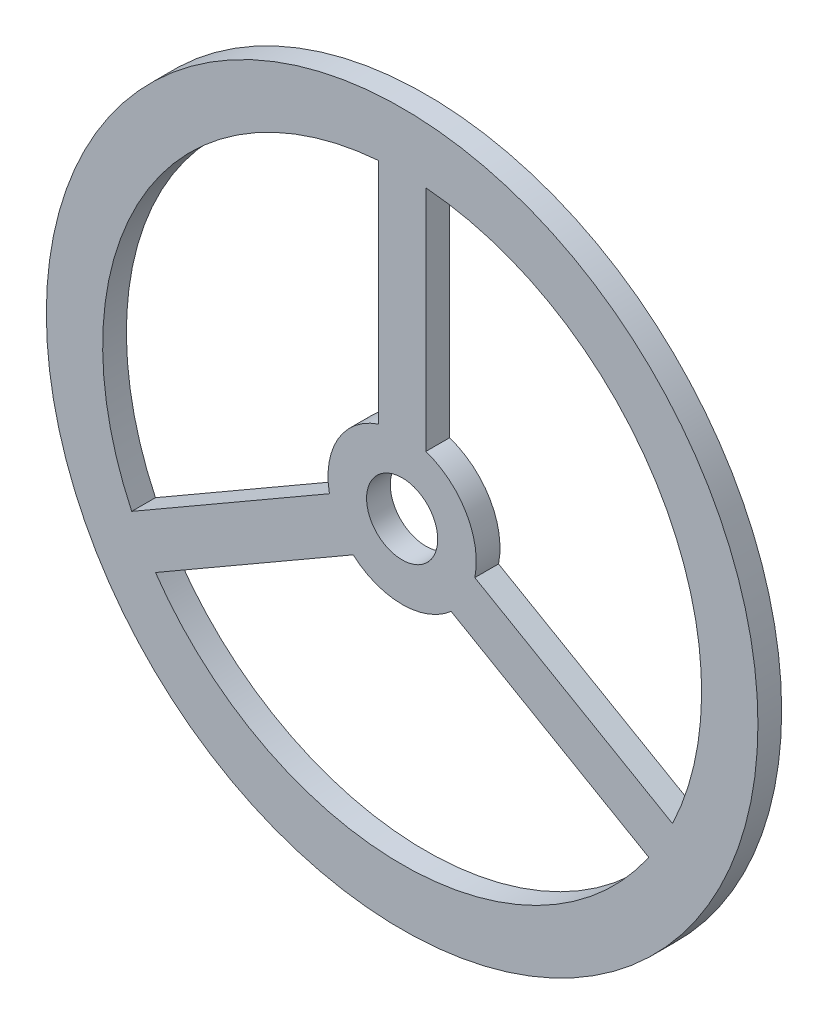
ISO-10303-21;
HEADER;
FILE_DESCRIPTION(('STEP AP214'),'2;1');
FILE_NAME('part.step','',(''),(''),'','','');
FILE_SCHEMA(('AUTOMOTIVE_DESIGN { 1 0 10303 214 1 1 1 1 }'));
ENDSEC;
DATA;
#1=APPLICATION_CONTEXT('core data for automotive mechanical design processes');
#2=APPLICATION_PROTOCOL_DEFINITION('international standard','automotive_design',2000,#1);
#3=PRODUCT_CONTEXT('',#1,'mechanical');
#4=PRODUCT('Part','Part','',(#3));
#5=PRODUCT_RELATED_PRODUCT_CATEGORY('part','',(#4));
#6=PRODUCT_DEFINITION_FORMATION('','',#4);
#7=PRODUCT_DEFINITION_CONTEXT('part definition',#1,'design');
#8=PRODUCT_DEFINITION('design','',#6,#7);
#9=PRODUCT_DEFINITION_SHAPE('','',#8);
#10=(LENGTH_UNIT() NAMED_UNIT(*) SI_UNIT(.MILLI.,.METRE.));
#11=(NAMED_UNIT(*) PLANE_ANGLE_UNIT() SI_UNIT($,.RADIAN.));
#12=(NAMED_UNIT(*) SI_UNIT($,.STERADIAN.) SOLID_ANGLE_UNIT());
#13=UNCERTAINTY_MEASURE_WITH_UNIT(LENGTH_MEASURE(1.E-05),#10,'distance_accuracy_value','');
#14=(GEOMETRIC_REPRESENTATION_CONTEXT(3) GLOBAL_UNCERTAINTY_ASSIGNED_CONTEXT((#13)) GLOBAL_UNIT_ASSIGNED_CONTEXT((#10,
#11,#12)) REPRESENTATION_CONTEXT('',''));
#15=CARTESIAN_POINT('',(0.,0.,0.));
#16=DIRECTION('',(0.,0.,1.));
#17=DIRECTION('',(1.,0.,0.));
#18=AXIS2_PLACEMENT_3D('',#15,#16,#17);
#19=CARTESIAN_POINT('',(0.,0.,4.));
#20=DIRECTION('',(0.,0.,1.));
#21=DIRECTION('',(1.,0.,0.));
#22=AXIS2_PLACEMENT_3D('',#19,#20,#21);
#23=PLANE('',#22);
#24=CARTESIAN_POINT('',(0.,0.,4.));
#25=DIRECTION('',(0.,0.,1.));
#26=DIRECTION('',(1.,0.,0.));
#27=AXIS2_PLACEMENT_3D('',#24,#25,#26);
#28=CIRCLE('',#27,60.);
#29=CARTESIAN_POINT('',(60.,0.,4.));
#30=VERTEX_POINT('',#29);
#31=EDGE_CURVE('E11',#30,#30,#28,.T.);
#32=ORIENTED_EDGE('',*,*,#31,.T.);
#33=EDGE_LOOP('',(#32));
#34=FACE_BOUND('',#33,.T.);
#35=CARTESIAN_POINT('',(0.,0.,4.));
#36=DIRECTION('',(0.,0.,1.));
#37=DIRECTION('',(1.,0.,0.));
#38=AXIS2_PLACEMENT_3D('',#35,#36,#37);
#39=CIRCLE('',#38,6.);
#40=CARTESIAN_POINT('',(6.,0.,4.));
#41=VERTEX_POINT('',#40);
#42=EDGE_CURVE('E220',#41,#41,#39,.T.);
#43=ORIENTED_EDGE('',*,*,#42,.F.);
#44=EDGE_LOOP('',(#43));
#45=FACE_BOUND('',#44,.T.);
#46=DIRECTION('',(0.,1.,0.));
#47=VECTOR('',#46,1.);
#48=CARTESIAN_POINT('',(-4.,11.842719282327,4.));
#49=LINE('',#48,#47);
#50=CARTESIAN_POINT('',(-4.,11.842719282327,4.));
#51=VERTEX_POINT('',#50);
#52=CARTESIAN_POINT('',(-4.,50.3413349048275,4.));
#53=VERTEX_POINT('',#52);
#54=EDGE_CURVE('E191',#51,#53,#49,.T.);
#55=ORIENTED_EDGE('',*,*,#54,.F.);
#56=CARTESIAN_POINT('',(0.,0.,4.));
#57=DIRECTION('',(0.,0.,-1.));
#58=DIRECTION('',(1.,0.,0.));
#59=AXIS2_PLACEMENT_3D('',#56,#57,#58);
#60=CIRCLE('',#59,12.5);
#61=CARTESIAN_POINT('',(-12.256095748383,-2.45725802602564,4.));
#62=VERTEX_POINT('',#61);
#63=EDGE_CURVE('E189',#62,#51,#60,.T.);
#64=ORIENTED_EDGE('',*,*,#63,.F.);
#65=DIRECTION('',(0.866025403784437,0.500000000000003,0.));
#66=VECTOR('',#65,1.);
#67=CARTESIAN_POINT('',(-12.256095748383,-2.45725802602564,4.));
#68=LINE('',#67,#66);
#69=CARTESIAN_POINT('',(-45.5968748880008,-21.706565837276,4.));
#70=VERTEX_POINT('',#69);
#71=EDGE_CURVE('E197',#70,#62,#68,.T.);
#72=ORIENTED_EDGE('',*,*,#71,.F.);
#73=CARTESIAN_POINT('',(0.,0.,4.));
#74=DIRECTION('',(0.,0.,1.));
#75=DIRECTION('',(1.,0.,0.));
#76=AXIS2_PLACEMENT_3D('',#73,#74,#75);
#77=CIRCLE('',#76,50.5);
#78=EDGE_CURVE('E194',#53,#70,#77,.T.);
#79=ORIENTED_EDGE('',*,*,#78,.F.);
#80=EDGE_LOOP('',(#55,#64,#72,#79));
#81=FACE_BOUND('',#80,.T.);
#82=DIRECTION('',(0.866025403784439,-0.499999999999998,0.));
#83=VECTOR('',#82,1.);
#84=CARTESIAN_POINT('',(12.256095748383,-2.45725802602581,4.));
#85=LINE('',#84,#83);
#86=CARTESIAN_POINT('',(12.256095748383,-2.45725802602581,4.));
#87=VERTEX_POINT('',#86);
#88=CARTESIAN_POINT('',(45.5968748880009,-21.706565837276,4.));
#89=VERTEX_POINT('',#88);
#90=EDGE_CURVE('E160',#87,#89,#85,.T.);
#91=ORIENTED_EDGE('',*,*,#90,.F.);
#92=CARTESIAN_POINT('',(0.,0.,4.));
#93=DIRECTION('',(0.,0.,-1.));
#94=DIRECTION('',(1.,0.,0.));
#95=AXIS2_PLACEMENT_3D('',#92,#93,#94);
#96=CIRCLE('',#95,12.5);
#97=CARTESIAN_POINT('',(4.,11.842719282327,4.));
#98=VERTEX_POINT('',#97);
#99=EDGE_CURVE('E158',#98,#87,#96,.T.);
#100=ORIENTED_EDGE('',*,*,#99,.F.);
#101=DIRECTION('',(0.,-1.,0.));
#102=VECTOR('',#101,1.);
#103=CARTESIAN_POINT('',(4.,11.842719282327,4.));
#104=LINE('',#103,#102);
#105=CARTESIAN_POINT('',(4.,50.3413349048275,4.));
#106=VERTEX_POINT('',#105);
#107=EDGE_CURVE('E166',#106,#98,#104,.T.);
#108=ORIENTED_EDGE('',*,*,#107,.F.);
#109=CARTESIAN_POINT('',(0.,0.,4.));
#110=DIRECTION('',(0.,0.,1.));
#111=DIRECTION('',(1.,0.,0.));
#112=AXIS2_PLACEMENT_3D('',#109,#110,#111);
#113=CIRCLE('',#112,50.5);
#114=EDGE_CURVE('E163',#89,#106,#113,.T.);
#115=ORIENTED_EDGE('',*,*,#114,.F.);
#116=EDGE_LOOP('',(#91,#100,#108,#115));
#117=FACE_BOUND('',#116,.T.);
#118=DIRECTION('',(-0.866025403784437,-0.500000000000003,0.));
#119=VECTOR('',#118,1.);
#120=CARTESIAN_POINT('',(-8.2560957483831,-9.38546125630118,4.));
#121=LINE('',#120,#119);
#122=CARTESIAN_POINT('',(-8.2560957483831,-9.38546125630118,4.));
#123=VERTEX_POINT('',#122);
#124=CARTESIAN_POINT('',(-41.5968748880009,-28.6347690675515,4.));
#125=VERTEX_POINT('',#124);
#126=EDGE_CURVE('E130',#123,#125,#121,.T.);
#127=ORIENTED_EDGE('',*,*,#126,.F.);
#128=CARTESIAN_POINT('',(0.,0.,4.));
#129=DIRECTION('',(0.,0.,-1.));
#130=DIRECTION('',(1.,0.,0.));
#131=AXIS2_PLACEMENT_3D('',#128,#129,#130);
#132=CIRCLE('',#131,12.5);
#133=CARTESIAN_POINT('',(8.25609574838296,-9.3854612563013,4.));
#134=VERTEX_POINT('',#133);
#135=EDGE_CURVE('E122',#134,#123,#132,.T.);
#136=ORIENTED_EDGE('',*,*,#135,.F.);
#137=DIRECTION('',(-0.86602540378444,0.499999999999998,0.));
#138=VECTOR('',#137,1.);
#139=CARTESIAN_POINT('',(8.25609574838296,-9.3854612563013,4.));
#140=LINE('',#139,#138);
#141=CARTESIAN_POINT('',(41.5968748880009,-28.6347690675515,4.));
#142=VERTEX_POINT('',#141);
#143=EDGE_CURVE('E144',#142,#134,#140,.T.);
#144=ORIENTED_EDGE('',*,*,#143,.F.);
#145=CARTESIAN_POINT('',(0.,0.,4.));
#146=DIRECTION('',(0.,0.,1.));
#147=DIRECTION('',(1.,0.,0.));
#148=AXIS2_PLACEMENT_3D('',#145,#146,#147);
#149=CIRCLE('',#148,50.5);
#150=EDGE_CURVE('E142',#125,#142,#149,.T.);
#151=ORIENTED_EDGE('',*,*,#150,.F.);
#152=EDGE_LOOP('',(#127,#136,#144,#151));
#153=FACE_BOUND('',#152,.T.);
#154=ADVANCED_FACE('F33',(#34,#45,#81,#117,#153),#23,.T.);
#155=CARTESIAN_POINT('',(0.,0.,0.));
#156=DIRECTION('',(0.,0.,1.));
#157=DIRECTION('',(1.,0.,0.));
#158=AXIS2_PLACEMENT_3D('',#155,#156,#157);
#159=PLANE('',#158);
#160=CARTESIAN_POINT('',(0.,0.,0.));
#161=DIRECTION('',(0.,0.,-1.));
#162=DIRECTION('',(1.,0.,0.));
#163=AXIS2_PLACEMENT_3D('',#160,#161,#162);
#164=CIRCLE('',#163,12.5);
#165=CARTESIAN_POINT('',(4.,11.842719282327,0.));
#166=VERTEX_POINT('',#165);
#167=CARTESIAN_POINT('',(12.256095748383,-2.45725802602581,0.));
#168=VERTEX_POINT('',#167);
#169=EDGE_CURVE('E138',#166,#168,#164,.T.);
#170=ORIENTED_EDGE('',*,*,#169,.T.);
#171=DIRECTION('',(0.866025403784439,-0.499999999999998,0.));
#172=VECTOR('',#171,1.);
#173=CARTESIAN_POINT('',(12.256095748383,-2.45725802602581,0.));
#174=LINE('',#173,#172);
#175=CARTESIAN_POINT('',(45.5968748880009,-21.706565837276,0.));
#176=VERTEX_POINT('',#175);
#177=EDGE_CURVE('E171',#168,#176,#174,.T.);
#178=ORIENTED_EDGE('',*,*,#177,.T.);
#179=CARTESIAN_POINT('',(0.,0.,0.));
#180=DIRECTION('',(0.,0.,1.));
#181=DIRECTION('',(1.,0.,0.));
#182=AXIS2_PLACEMENT_3D('',#179,#180,#181);
#183=CIRCLE('',#182,50.5);
#184=CARTESIAN_POINT('',(4.,50.3413349048275,0.));
#185=VERTEX_POINT('',#184);
#186=EDGE_CURVE('E174',#176,#185,#183,.T.);
#187=ORIENTED_EDGE('',*,*,#186,.T.);
#188=DIRECTION('',(0.,-1.,0.));
#189=VECTOR('',#188,1.);
#190=CARTESIAN_POINT('',(4.,11.842719282327,0.));
#191=LINE('',#190,#189);
#192=EDGE_CURVE('E161',#185,#166,#191,.T.);
#193=ORIENTED_EDGE('',*,*,#192,.T.);
#194=EDGE_LOOP('',(#170,#178,#187,#193));
#195=FACE_BOUND('',#194,.T.);
#196=CARTESIAN_POINT('',(0.,0.,0.));
#197=DIRECTION('',(0.,0.,1.));
#198=DIRECTION('',(1.,0.,0.));
#199=AXIS2_PLACEMENT_3D('',#196,#197,#198);
#200=CIRCLE('',#199,6.);
#201=CARTESIAN_POINT('',(6.,0.,0.));
#202=VERTEX_POINT('',#201);
#203=EDGE_CURVE('E219',#202,#202,#200,.T.);
#204=ORIENTED_EDGE('',*,*,#203,.T.);
#205=EDGE_LOOP('',(#204));
#206=FACE_BOUND('',#205,.T.);
#207=CARTESIAN_POINT('',(0.,0.,0.));
#208=DIRECTION('',(0.,0.,1.));
#209=DIRECTION('',(1.,0.,0.));
#210=AXIS2_PLACEMENT_3D('',#207,#208,#209);
#211=CIRCLE('',#210,60.);
#212=CARTESIAN_POINT('',(60.,0.,0.));
#213=VERTEX_POINT('',#212);
#214=EDGE_CURVE('E37',#213,#213,#211,.T.);
#215=ORIENTED_EDGE('',*,*,#214,.F.);
#216=EDGE_LOOP('',(#215));
#217=FACE_BOUND('',#216,.T.);
#218=CARTESIAN_POINT('',(0.,0.,0.));
#219=DIRECTION('',(0.,0.,-1.));
#220=DIRECTION('',(1.,0.,0.));
#221=AXIS2_PLACEMENT_3D('',#218,#219,#220);
#222=CIRCLE('',#221,12.5);
#223=CARTESIAN_POINT('',(-12.256095748383,-2.45725802602564,0.));
#224=VERTEX_POINT('',#223);
#225=CARTESIAN_POINT('',(-4.,11.842719282327,0.));
#226=VERTEX_POINT('',#225);
#227=EDGE_CURVE('E188',#224,#226,#222,.T.);
#228=ORIENTED_EDGE('',*,*,#227,.T.);
#229=DIRECTION('',(0.,1.,0.));
#230=VECTOR('',#229,1.);
#231=CARTESIAN_POINT('',(-4.,11.842719282327,0.));
#232=LINE('',#231,#230);
#233=CARTESIAN_POINT('',(-4.,50.3413349048275,0.));
#234=VERTEX_POINT('',#233);
#235=EDGE_CURVE('E202',#226,#234,#232,.T.);
#236=ORIENTED_EDGE('',*,*,#235,.T.);
#237=CARTESIAN_POINT('',(0.,0.,0.));
#238=DIRECTION('',(0.,0.,1.));
#239=DIRECTION('',(1.,0.,0.));
#240=AXIS2_PLACEMENT_3D('',#237,#238,#239);
#241=CIRCLE('',#240,50.5);
#242=CARTESIAN_POINT('',(-45.5968748880008,-21.706565837276,0.));
#243=VERTEX_POINT('',#242);
#244=EDGE_CURVE('E205',#234,#243,#241,.T.);
#245=ORIENTED_EDGE('',*,*,#244,.T.);
#246=DIRECTION('',(0.866025403784437,0.500000000000003,0.));
#247=VECTOR('',#246,1.);
#248=CARTESIAN_POINT('',(-12.256095748383,-2.45725802602564,0.));
#249=LINE('',#248,#247);
#250=EDGE_CURVE('E192',#243,#224,#249,.T.);
#251=ORIENTED_EDGE('',*,*,#250,.T.);
#252=EDGE_LOOP('',(#228,#236,#245,#251));
#253=FACE_BOUND('',#252,.T.);
#254=CARTESIAN_POINT('',(0.,0.,0.));
#255=DIRECTION('',(0.,0.,-1.));
#256=DIRECTION('',(1.,0.,0.));
#257=AXIS2_PLACEMENT_3D('',#254,#255,#256);
#258=CIRCLE('',#257,12.5);
#259=CARTESIAN_POINT('',(8.25609574838296,-9.3854612563013,0.));
#260=VERTEX_POINT('',#259);
#261=CARTESIAN_POINT('',(-8.2560957483831,-9.38546125630118,0.));
#262=VERTEX_POINT('',#261);
#263=EDGE_CURVE('E56',#260,#262,#258,.T.);
#264=ORIENTED_EDGE('',*,*,#263,.T.);
#265=DIRECTION('',(-0.866025403784437,-0.500000000000003,0.));
#266=VECTOR('',#265,1.);
#267=CARTESIAN_POINT('',(-8.2560957483831,-9.38546125630118,0.));
#268=LINE('',#267,#266);
#269=CARTESIAN_POINT('',(-41.5968748880009,-28.6347690675515,0.));
#270=VERTEX_POINT('',#269);
#271=EDGE_CURVE('E137',#262,#270,#268,.T.);
#272=ORIENTED_EDGE('',*,*,#271,.T.);
#273=CARTESIAN_POINT('',(0.,0.,0.));
#274=DIRECTION('',(0.,0.,1.));
#275=DIRECTION('',(1.,0.,0.));
#276=AXIS2_PLACEMENT_3D('',#273,#274,#275);
#277=CIRCLE('',#276,50.5);
#278=CARTESIAN_POINT('',(41.5968748880009,-28.6347690675515,0.));
#279=VERTEX_POINT('',#278);
#280=EDGE_CURVE('E150',#270,#279,#277,.T.);
#281=ORIENTED_EDGE('',*,*,#280,.T.);
#282=DIRECTION('',(-0.86602540378444,0.499999999999998,0.));
#283=VECTOR('',#282,1.);
#284=CARTESIAN_POINT('',(8.25609574838296,-9.3854612563013,0.));
#285=LINE('',#284,#283);
#286=EDGE_CURVE('E131',#279,#260,#285,.T.);
#287=ORIENTED_EDGE('',*,*,#286,.T.);
#288=EDGE_LOOP('',(#264,#272,#281,#287));
#289=FACE_BOUND('',#288,.T.);
#290=ADVANCED_FACE('F226',(#195,#206,#217,#253,#289),#159,.F.);
#291=CARTESIAN_POINT('',(0.,0.,4.));
#292=DIRECTION('',(0.,0.,-1.));
#293=DIRECTION('',(-1.,0.,0.));
#294=AXIS2_PLACEMENT_3D('',#291,#292,#293);
#295=CYLINDRICAL_SURFACE('',#294,60.);
#296=ORIENTED_EDGE('',*,*,#31,.F.);
#297=EDGE_LOOP('',(#296));
#298=FACE_BOUND('',#297,.T.);
#299=ORIENTED_EDGE('',*,*,#214,.T.);
#300=EDGE_LOOP('',(#299));
#301=FACE_BOUND('',#300,.T.);
#302=ADVANCED_FACE('F35',(#298,#301),#295,.T.);
#303=CARTESIAN_POINT('',(0.,0.,4.));
#304=DIRECTION('',(0.,0.,-1.));
#305=DIRECTION('',(-1.,0.,0.));
#306=AXIS2_PLACEMENT_3D('',#303,#304,#305);
#307=CYLINDRICAL_SURFACE('',#306,6.);
#308=ORIENTED_EDGE('',*,*,#42,.T.);
#309=EDGE_LOOP('',(#308));
#310=FACE_BOUND('',#309,.T.);
#311=ORIENTED_EDGE('',*,*,#203,.F.);
#312=EDGE_LOOP('',(#311));
#313=FACE_BOUND('',#312,.T.);
#314=ADVANCED_FACE('F229',(#310,#313),#307,.F.);
#315=CARTESIAN_POINT('',(0.,0.,4.));
#316=DIRECTION('',(0.,0.,-1.));
#317=DIRECTION('',(-1.,0.,0.));
#318=AXIS2_PLACEMENT_3D('',#315,#316,#317);
#319=CYLINDRICAL_SURFACE('',#318,12.5);
#320=ORIENTED_EDGE('',*,*,#227,.F.);
#321=DIRECTION('',(0.,0.,-1.));
#322=VECTOR('',#321,1.);
#323=CARTESIAN_POINT('',(-12.256095748383,-2.45725802602564,4.));
#324=LINE('',#323,#322);
#325=EDGE_CURVE('E199',#62,#224,#324,.T.);
#326=ORIENTED_EDGE('',*,*,#325,.F.);
#327=ORIENTED_EDGE('',*,*,#63,.T.);
#328=DIRECTION('',(0.,0.,-1.));
#329=VECTOR('',#328,1.);
#330=CARTESIAN_POINT('',(-4.,11.842719282327,4.));
#331=LINE('',#330,#329);
#332=EDGE_CURVE('E216',#51,#226,#331,.T.);
#333=ORIENTED_EDGE('',*,*,#332,.T.);
#334=EDGE_LOOP('',(#320,#326,#327,#333));
#335=FACE_BOUND('',#334,.T.);
#336=ADVANCED_FACE('F231',(#335),#319,.T.);
#337=CARTESIAN_POINT('',(-4.,11.842719282327,4.));
#338=DIRECTION('',(-1.,0.,0.));
#339=DIRECTION('',(0.,0.,1.));
#340=AXIS2_PLACEMENT_3D('',#337,#338,#339);
#341=PLANE('',#340);
#342=ORIENTED_EDGE('',*,*,#235,.F.);
#343=ORIENTED_EDGE('',*,*,#332,.F.);
#344=ORIENTED_EDGE('',*,*,#54,.T.);
#345=DIRECTION('',(0.,0.,-1.));
#346=VECTOR('',#345,1.);
#347=CARTESIAN_POINT('',(-4.,50.3413349048275,4.));
#348=LINE('',#347,#346);
#349=EDGE_CURVE('E214',#53,#234,#348,.T.);
#350=ORIENTED_EDGE('',*,*,#349,.T.);
#351=EDGE_LOOP('',(#342,#343,#344,#350));
#352=FACE_BOUND('',#351,.T.);
#353=ADVANCED_FACE('F238',(#352),#341,.T.);
#354=CARTESIAN_POINT('',(0.,0.,4.));
#355=DIRECTION('',(0.,0.,-1.));
#356=DIRECTION('',(-1.,0.,0.));
#357=AXIS2_PLACEMENT_3D('',#354,#355,#356);
#358=CYLINDRICAL_SURFACE('',#357,50.5);
#359=ORIENTED_EDGE('',*,*,#244,.F.);
#360=ORIENTED_EDGE('',*,*,#349,.F.);
#361=ORIENTED_EDGE('',*,*,#78,.T.);
#362=DIRECTION('',(0.,0.,-1.));
#363=VECTOR('',#362,1.);
#364=CARTESIAN_POINT('',(-45.5968748880008,-21.706565837276,4.));
#365=LINE('',#364,#363);
#366=EDGE_CURVE('E212',#70,#243,#365,.T.);
#367=ORIENTED_EDGE('',*,*,#366,.T.);
#368=EDGE_LOOP('',(#359,#360,#361,#367));
#369=FACE_BOUND('',#368,.T.);
#370=ADVANCED_FACE('F291',(#369),#358,.F.);
#371=CARTESIAN_POINT('',(-12.256095748383,-2.45725802602564,4.));
#372=DIRECTION('',(-0.500000000000003,0.866025403784437,0.));
#373=DIRECTION('',(-0.866025403784437,-0.500000000000003,0.));
#374=AXIS2_PLACEMENT_3D('',#371,#372,#373);
#375=PLANE('',#374);
#376=ORIENTED_EDGE('',*,*,#250,.F.);
#377=ORIENTED_EDGE('',*,*,#366,.F.);
#378=ORIENTED_EDGE('',*,*,#71,.T.);
#379=ORIENTED_EDGE('',*,*,#325,.T.);
#380=EDGE_LOOP('',(#376,#377,#378,#379));
#381=FACE_BOUND('',#380,.T.);
#382=ADVANCED_FACE('F288',(#381),#375,.T.);
#383=CARTESIAN_POINT('',(0.,0.,4.));
#384=DIRECTION('',(0.,0.,-1.));
#385=DIRECTION('',(-1.,0.,0.));
#386=AXIS2_PLACEMENT_3D('',#383,#384,#385);
#387=CYLINDRICAL_SURFACE('',#386,12.5);
#388=ORIENTED_EDGE('',*,*,#169,.F.);
#389=DIRECTION('',(0.,0.,-1.));
#390=VECTOR('',#389,1.);
#391=CARTESIAN_POINT('',(4.,11.842719282327,4.));
#392=LINE('',#391,#390);
#393=EDGE_CURVE('E168',#98,#166,#392,.T.);
#394=ORIENTED_EDGE('',*,*,#393,.F.);
#395=ORIENTED_EDGE('',*,*,#99,.T.);
#396=DIRECTION('',(0.,0.,-1.));
#397=VECTOR('',#396,1.);
#398=CARTESIAN_POINT('',(12.256095748383,-2.45725802602581,4.));
#399=LINE('',#398,#397);
#400=EDGE_CURVE('E185',#87,#168,#399,.T.);
#401=ORIENTED_EDGE('',*,*,#400,.T.);
#402=EDGE_LOOP('',(#388,#394,#395,#401));
#403=FACE_BOUND('',#402,.T.);
#404=ADVANCED_FACE('F270',(#403),#387,.T.);
#405=CARTESIAN_POINT('',(12.256095748383,-2.45725802602581,4.));
#406=DIRECTION('',(0.499999999999999,0.86602540378444,0.));
#407=DIRECTION('',(-0.866025403784439,0.499999999999998,0.));
#408=AXIS2_PLACEMENT_3D('',#405,#406,#407);
#409=PLANE('',#408);
#410=ORIENTED_EDGE('',*,*,#177,.F.);
#411=ORIENTED_EDGE('',*,*,#400,.F.);
#412=ORIENTED_EDGE('',*,*,#90,.T.);
#413=DIRECTION('',(0.,0.,-1.));
#414=VECTOR('',#413,1.);
#415=CARTESIAN_POINT('',(45.5968748880009,-21.706565837276,4.));
#416=LINE('',#415,#414);
#417=EDGE_CURVE('E183',#89,#176,#416,.T.);
#418=ORIENTED_EDGE('',*,*,#417,.T.);
#419=EDGE_LOOP('',(#410,#411,#412,#418));
#420=FACE_BOUND('',#419,.T.);
#421=ADVANCED_FACE('F264',(#420),#409,.T.);
#422=CARTESIAN_POINT('',(0.,0.,4.));
#423=DIRECTION('',(0.,0.,-1.));
#424=DIRECTION('',(-1.,0.,0.));
#425=AXIS2_PLACEMENT_3D('',#422,#423,#424);
#426=CYLINDRICAL_SURFACE('',#425,50.5);
#427=ORIENTED_EDGE('',*,*,#186,.F.);
#428=ORIENTED_EDGE('',*,*,#417,.F.);
#429=ORIENTED_EDGE('',*,*,#114,.T.);
#430=DIRECTION('',(0.,0.,-1.));
#431=VECTOR('',#430,1.);
#432=CARTESIAN_POINT('',(4.,50.3413349048275,4.));
#433=LINE('',#432,#431);
#434=EDGE_CURVE('E181',#106,#185,#433,.T.);
#435=ORIENTED_EDGE('',*,*,#434,.T.);
#436=EDGE_LOOP('',(#427,#428,#429,#435));
#437=FACE_BOUND('',#436,.T.);
#438=ADVANCED_FACE('F267',(#437),#426,.F.);
#439=CARTESIAN_POINT('',(4.,11.842719282327,4.));
#440=DIRECTION('',(1.,0.,0.));
#441=DIRECTION('',(0.,0.,-1.));
#442=AXIS2_PLACEMENT_3D('',#439,#440,#441);
#443=PLANE('',#442);
#444=ORIENTED_EDGE('',*,*,#192,.F.);
#445=ORIENTED_EDGE('',*,*,#434,.F.);
#446=ORIENTED_EDGE('',*,*,#107,.T.);
#447=ORIENTED_EDGE('',*,*,#393,.T.);
#448=EDGE_LOOP('',(#444,#445,#446,#447));
#449=FACE_BOUND('',#448,.T.);
#450=ADVANCED_FACE('F273',(#449),#443,.T.);
#451=CARTESIAN_POINT('',(0.,0.,4.));
#452=DIRECTION('',(0.,0.,-1.));
#453=DIRECTION('',(-1.,0.,0.));
#454=AXIS2_PLACEMENT_3D('',#451,#452,#453);
#455=CYLINDRICAL_SURFACE('',#454,12.5);
#456=ORIENTED_EDGE('',*,*,#263,.F.);
#457=DIRECTION('',(0.,0.,-1.));
#458=VECTOR('',#457,1.);
#459=CARTESIAN_POINT('',(8.25609574838296,-9.3854612563013,4.));
#460=LINE('',#459,#458);
#461=EDGE_CURVE('E126',#134,#260,#460,.T.);
#462=ORIENTED_EDGE('',*,*,#461,.F.);
#463=ORIENTED_EDGE('',*,*,#135,.T.);
#464=DIRECTION('',(0.,0.,-1.));
#465=VECTOR('',#464,1.);
#466=CARTESIAN_POINT('',(-8.2560957483831,-9.38546125630118,4.));
#467=LINE('',#466,#465);
#468=EDGE_CURVE('E125',#123,#262,#467,.T.);
#469=ORIENTED_EDGE('',*,*,#468,.T.);
#470=EDGE_LOOP('',(#456,#462,#463,#469));
#471=FACE_BOUND('',#470,.T.);
#472=ADVANCED_FACE('F124',(#471),#455,.T.);
#473=CARTESIAN_POINT('',(-8.2560957483831,-9.38546125630118,4.));
#474=DIRECTION('',(0.500000000000003,-0.866025403784437,0.));
#475=DIRECTION('',(0.866025403784437,0.500000000000003,0.));
#476=AXIS2_PLACEMENT_3D('',#473,#474,#475);
#477=PLANE('',#476);
#478=ORIENTED_EDGE('',*,*,#271,.F.);
#479=ORIENTED_EDGE('',*,*,#468,.F.);
#480=ORIENTED_EDGE('',*,*,#126,.T.);
#481=DIRECTION('',(0.,0.,-1.));
#482=VECTOR('',#481,1.);
#483=CARTESIAN_POINT('',(-41.5968748880009,-28.6347690675515,4.));
#484=LINE('',#483,#482);
#485=EDGE_CURVE('E139',#125,#270,#484,.T.);
#486=ORIENTED_EDGE('',*,*,#485,.T.);
#487=EDGE_LOOP('',(#478,#479,#480,#486));
#488=FACE_BOUND('',#487,.T.);
#489=ADVANCED_FACE('F134',(#488),#477,.T.);
#490=CARTESIAN_POINT('',(0.,0.,4.));
#491=DIRECTION('',(0.,0.,-1.));
#492=DIRECTION('',(-1.,0.,0.));
#493=AXIS2_PLACEMENT_3D('',#490,#491,#492);
#494=CYLINDRICAL_SURFACE('',#493,50.5);
#495=ORIENTED_EDGE('',*,*,#280,.F.);
#496=ORIENTED_EDGE('',*,*,#485,.F.);
#497=ORIENTED_EDGE('',*,*,#150,.T.);
#498=DIRECTION('',(0.,0.,-1.));
#499=VECTOR('',#498,1.);
#500=CARTESIAN_POINT('',(41.5968748880009,-28.6347690675515,4.));
#501=LINE('',#500,#499);
#502=EDGE_CURVE('E48',#142,#279,#501,.T.);
#503=ORIENTED_EDGE('',*,*,#502,.T.);
#504=EDGE_LOOP('',(#495,#496,#497,#503));
#505=FACE_BOUND('',#504,.T.);
#506=ADVANCED_FACE('F311',(#505),#494,.F.);
#507=CARTESIAN_POINT('',(8.25609574838296,-9.3854612563013,4.));
#508=DIRECTION('',(-0.499999999999998,-0.86602540378444,0.));
#509=DIRECTION('',(0.86602540378444,-0.499999999999998,0.));
#510=AXIS2_PLACEMENT_3D('',#507,#508,#509);
#511=PLANE('',#510);
#512=ORIENTED_EDGE('',*,*,#286,.F.);
#513=ORIENTED_EDGE('',*,*,#502,.F.);
#514=ORIENTED_EDGE('',*,*,#143,.T.);
#515=ORIENTED_EDGE('',*,*,#461,.T.);
#516=EDGE_LOOP('',(#512,#513,#514,#515));
#517=FACE_BOUND('',#516,.T.);
#518=ADVANCED_FACE('F309',(#517),#511,.T.);
#519=CLOSED_SHELL('',(#154,#290,#302,#314,#336,#353,#370,#382,#404,#421,#438,#450,#472,#489,
#506,#518));
#520=MANIFOLD_SOLID_BREP('B2',#519);
#521=ADVANCED_BREP_SHAPE_REPRESENTATION('',(#18,#520),#14);
#522=SHAPE_DEFINITION_REPRESENTATION(#9,#521);
ENDSEC;
END-ISO-10303-21;
